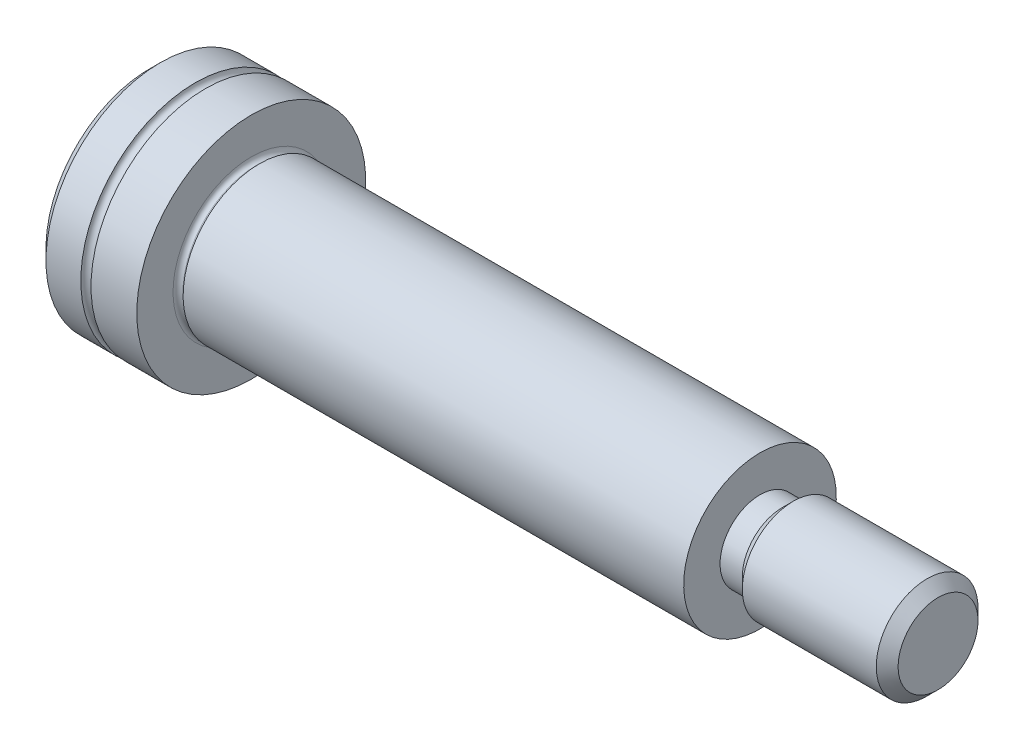
ISO-10303-21;
HEADER;
FILE_DESCRIPTION(('STEP AP214'),'2;1');
FILE_NAME('part.step','',(''),(''),'','','');
FILE_SCHEMA(('AUTOMOTIVE_DESIGN { 1 0 10303 214 1 1 1 1 }'));
ENDSEC;
DATA;
#1=APPLICATION_CONTEXT('core data for automotive mechanical design processes');
#2=APPLICATION_PROTOCOL_DEFINITION('international standard','automotive_design',2000,#1);
#3=PRODUCT_CONTEXT('',#1,'mechanical');
#4=PRODUCT('Part','Part','',(#3));
#5=PRODUCT_RELATED_PRODUCT_CATEGORY('part','',(#4));
#6=PRODUCT_DEFINITION_FORMATION('','',#4);
#7=PRODUCT_DEFINITION_CONTEXT('part definition',#1,'design');
#8=PRODUCT_DEFINITION('design','',#6,#7);
#9=PRODUCT_DEFINITION_SHAPE('','',#8);
#10=(LENGTH_UNIT() NAMED_UNIT(*) SI_UNIT(.MILLI.,.METRE.));
#11=(NAMED_UNIT(*) PLANE_ANGLE_UNIT() SI_UNIT($,.RADIAN.));
#12=(NAMED_UNIT(*) SI_UNIT($,.STERADIAN.) SOLID_ANGLE_UNIT());
#13=UNCERTAINTY_MEASURE_WITH_UNIT(LENGTH_MEASURE(1.E-05),#10,'distance_accuracy_value','');
#14=(GEOMETRIC_REPRESENTATION_CONTEXT(3) GLOBAL_UNCERTAINTY_ASSIGNED_CONTEXT((#13)) GLOBAL_UNIT_ASSIGNED_CONTEXT((#10,
#11,#12)) REPRESENTATION_CONTEXT('',''));
#15=CARTESIAN_POINT('',(0.,0.,0.));
#16=DIRECTION('',(0.,0.,1.));
#17=DIRECTION('',(1.,0.,0.));
#18=AXIS2_PLACEMENT_3D('',#15,#16,#17);
#19=CARTESIAN_POINT('',(0.,0.,0.));
#20=DIRECTION('',(-1.,0.,0.));
#21=DIRECTION('',(0.,-1.,0.));
#22=AXIS2_PLACEMENT_3D('',#19,#20,#21);
#23=CYLINDRICAL_SURFACE('',#22,4.5);
#24=CARTESIAN_POINT('',(0.,0.,0.));
#25=DIRECTION('',(-1.,0.,0.));
#26=DIRECTION('',(0.,-1.,0.));
#27=AXIS2_PLACEMENT_3D('',#24,#25,#26);
#28=CIRCLE('',#27,4.5);
#29=CARTESIAN_POINT('',(0.,-4.5,0.));
#30=VERTEX_POINT('',#29);
#31=EDGE_CURVE('E161',#30,#30,#28,.T.);
#32=ORIENTED_EDGE('',*,*,#31,.T.);
#33=EDGE_LOOP('',(#32));
#34=FACE_BOUND('',#33,.T.);
#35=CARTESIAN_POINT('',(-1.8,0.,0.));
#36=DIRECTION('',(-1.,0.,0.));
#37=DIRECTION('',(0.,-1.,0.));
#38=AXIS2_PLACEMENT_3D('',#35,#36,#37);
#39=CIRCLE('',#38,4.5);
#40=CARTESIAN_POINT('',(-1.8,-4.5,0.));
#41=VERTEX_POINT('',#40);
#42=EDGE_CURVE('E167',#41,#41,#39,.T.);
#43=ORIENTED_EDGE('',*,*,#42,.F.);
#44=EDGE_LOOP('',(#43));
#45=FACE_BOUND('',#44,.T.);
#46=ADVANCED_FACE('F33',(#34,#45),#23,.T.);
#47=CARTESIAN_POINT('',(-2.,0.,0.));
#48=DIRECTION('',(-1.,0.,0.));
#49=DIRECTION('',(0.,-1.,0.));
#50=AXIS2_PLACEMENT_3D('',#47,#48,#49);
#51=TOROIDAL_SURFACE('',#50,4.5,0.200000000000001);
#52=ORIENTED_EDGE('',*,*,#42,.T.);
#53=EDGE_LOOP('',(#52));
#54=FACE_BOUND('',#53,.T.);
#55=CARTESIAN_POINT('',(-2.2,0.,0.));
#56=DIRECTION('',(-1.,0.,0.));
#57=DIRECTION('',(0.,-1.,0.));
#58=AXIS2_PLACEMENT_3D('',#55,#56,#57);
#59=CIRCLE('',#58,4.5);
#60=CARTESIAN_POINT('',(-2.2,-4.5,0.));
#61=VERTEX_POINT('',#60);
#62=EDGE_CURVE('E164',#61,#61,#59,.T.);
#63=ORIENTED_EDGE('',*,*,#62,.F.);
#64=EDGE_LOOP('',(#63));
#65=FACE_BOUND('',#64,.T.);
#66=ADVANCED_FACE('F197',(#54,#65),#51,.F.);
#67=CARTESIAN_POINT('',(0.,0.,0.));
#68=DIRECTION('',(-1.,0.,0.));
#69=DIRECTION('',(0.,-1.,0.));
#70=AXIS2_PLACEMENT_3D('',#67,#68,#69);
#71=CYLINDRICAL_SURFACE('',#70,4.5);
#72=CARTESIAN_POINT('',(-3.57049999998492,0.,0.));
#73=DIRECTION('',(-1.,0.,0.));
#74=DIRECTION('',(0.,-1.,0.));
#75=AXIS2_PLACEMENT_3D('',#72,#73,#74);
#76=CIRCLE('',#75,4.5);
#77=CARTESIAN_POINT('',(-3.57049999998492,-4.5,0.));
#78=VERTEX_POINT('',#77);
#79=EDGE_CURVE('E173',#78,#78,#76,.F.);
#80=ORIENTED_EDGE('',*,*,#79,.T.);
#81=EDGE_LOOP('',(#80));
#82=FACE_BOUND('',#81,.T.);
#83=ORIENTED_EDGE('',*,*,#62,.T.);
#84=EDGE_LOOP('',(#83));
#85=FACE_BOUND('',#84,.T.);
#86=ADVANCED_FACE('F203',(#82,#85),#71,.T.);
#87=CARTESIAN_POINT('',(-4.,0.,0.));
#88=DIRECTION('',(-1.,0.,0.));
#89=DIRECTION('',(0.,-1.,0.));
#90=AXIS2_PLACEMENT_3D('',#87,#88,#89);
#91=PLANE('',#90);
#92=CARTESIAN_POINT('',(-4.,0.,0.));
#93=DIRECTION('',(-1.,0.,0.));
#94=DIRECTION('',(0.,-1.,0.));
#95=AXIS2_PLACEMENT_3D('',#92,#93,#94);
#96=CIRCLE('',#95,4.07050000004176);
#97=CARTESIAN_POINT('',(-4.,-4.07050000004176,0.));
#98=VERTEX_POINT('',#97);
#99=EDGE_CURVE('E170',#98,#98,#96,.T.);
#100=ORIENTED_EDGE('',*,*,#99,.T.);
#101=EDGE_LOOP('',(#100));
#102=FACE_BOUND('',#101,.T.);
#103=DIRECTION('',(0.,0.500000000000001,0.866025403784438));
#104=VECTOR('',#103,1.);
#105=CARTESIAN_POINT('',(-4.,-1.73205080756888,0.));
#106=LINE('',#105,#104);
#107=CARTESIAN_POINT('',(-4.,-1.73205080756888,0.));
#108=VERTEX_POINT('',#107);
#109=CARTESIAN_POINT('',(-4.,-0.866025403784439,1.5));
#110=VERTEX_POINT('',#109);
#111=EDGE_CURVE('E48',#108,#110,#106,.T.);
#112=ORIENTED_EDGE('',*,*,#111,.F.);
#113=DIRECTION('',(0.,-0.500000000000001,0.866025403784438));
#114=VECTOR('',#113,1.);
#115=CARTESIAN_POINT('',(-4.,-0.86602540378444,-1.5));
#116=LINE('',#115,#114);
#117=CARTESIAN_POINT('',(-4.,-0.86602540378444,-1.5));
#118=VERTEX_POINT('',#117);
#119=EDGE_CURVE('E134',#118,#108,#116,.T.);
#120=ORIENTED_EDGE('',*,*,#119,.F.);
#121=DIRECTION('',(0.,-1.,0.));
#122=VECTOR('',#121,1.);
#123=CARTESIAN_POINT('',(-4.,0.866025403784438,-1.5));
#124=LINE('',#123,#122);
#125=CARTESIAN_POINT('',(-4.,0.866025403784438,-1.5));
#126=VERTEX_POINT('',#125);
#127=EDGE_CURVE('E132',#126,#118,#124,.T.);
#128=ORIENTED_EDGE('',*,*,#127,.F.);
#129=DIRECTION('',(0.,-0.500000000000001,-0.866025403784438));
#130=VECTOR('',#129,1.);
#131=CARTESIAN_POINT('',(-4.,1.73205080756888,0.));
#132=LINE('',#131,#130);
#133=CARTESIAN_POINT('',(-4.,1.73205080756888,0.));
#134=VERTEX_POINT('',#133);
#135=EDGE_CURVE('E98',#134,#126,#132,.T.);
#136=ORIENTED_EDGE('',*,*,#135,.F.);
#137=DIRECTION('',(0.,0.5,-0.866025403784438));
#138=VECTOR('',#137,1.);
#139=CARTESIAN_POINT('',(-4.,0.86602540378444,1.5));
#140=LINE('',#139,#138);
#141=CARTESIAN_POINT('',(-4.,0.86602540378444,1.5));
#142=VERTEX_POINT('',#141);
#143=EDGE_CURVE('E128',#142,#134,#140,.T.);
#144=ORIENTED_EDGE('',*,*,#143,.F.);
#145=DIRECTION('',(0.,1.,0.));
#146=VECTOR('',#145,1.);
#147=CARTESIAN_POINT('',(-4.,-0.866025403784439,1.5));
#148=LINE('',#147,#146);
#149=EDGE_CURVE('E124',#110,#142,#148,.T.);
#150=ORIENTED_EDGE('',*,*,#149,.F.);
#151=EDGE_LOOP('',(#112,#120,#128,#136,#144,#150));
#152=FACE_BOUND('',#151,.T.);
#153=ADVANCED_FACE('F221',(#102,#152),#91,.T.);
#154=CARTESIAN_POINT('',(0.,4.5,0.));
#155=DIRECTION('',(1.,0.,0.));
#156=DIRECTION('',(0.,1.,0.));
#157=AXIS2_PLACEMENT_3D('',#154,#155,#156);
#158=PLANE('',#157);
#159=CARTESIAN_POINT('',(0.,0.,0.));
#160=DIRECTION('',(1.,0.,0.));
#161=DIRECTION('',(0.,1.,0.));
#162=AXIS2_PLACEMENT_3D('',#159,#160,#161);
#163=CIRCLE('',#162,3.075);
#164=CARTESIAN_POINT('',(0.,3.075,0.));
#165=VERTEX_POINT('',#164);
#166=EDGE_CURVE('E11',#165,#165,#163,.F.);
#167=ORIENTED_EDGE('',*,*,#166,.T.);
#168=EDGE_LOOP('',(#167));
#169=FACE_BOUND('',#168,.T.);
#170=ORIENTED_EDGE('',*,*,#31,.F.);
#171=EDGE_LOOP('',(#170));
#172=FACE_BOUND('',#171,.T.);
#173=ADVANCED_FACE('F224',(#169,#172),#158,.T.);
#174=CARTESIAN_POINT('',(0.250717967674063,0.,0.));
#175=DIRECTION('',(-1.,0.,0.));
#176=DIRECTION('',(0.,-1.,0.));
#177=AXIS2_PLACEMENT_3D('',#174,#175,#176);
#178=CYLINDRICAL_SURFACE('',#177,2.88);
#179=CARTESIAN_POINT('',(0.195,0.,0.));
#180=DIRECTION('',(1.,0.,0.));
#181=DIRECTION('',(0.,1.,0.));
#182=AXIS2_PLACEMENT_3D('',#179,#180,#181);
#183=CIRCLE('',#182,2.88);
#184=CARTESIAN_POINT('',(0.195,2.88,0.));
#185=VERTEX_POINT('',#184);
#186=EDGE_CURVE('E41',#185,#185,#183,.T.);
#187=ORIENTED_EDGE('',*,*,#186,.T.);
#188=EDGE_LOOP('',(#187));
#189=FACE_BOUND('',#188,.T.);
#190=CARTESIAN_POINT('',(0.250717967674063,0.,0.));
#191=DIRECTION('',(1.,0.,0.));
#192=DIRECTION('',(0.,1.,0.));
#193=AXIS2_PLACEMENT_3D('',#190,#191,#192);
#194=CIRCLE('',#193,2.88);
#195=CARTESIAN_POINT('',(0.250717967674063,2.88,0.));
#196=VERTEX_POINT('',#195);
#197=EDGE_CURVE('E158',#196,#196,#194,.T.);
#198=ORIENTED_EDGE('',*,*,#197,.F.);
#199=EDGE_LOOP('',(#198));
#200=FACE_BOUND('',#199,.T.);
#201=ADVANCED_FACE('F184',(#189,#200),#178,.T.);
#202=CARTESIAN_POINT('',(0.250717967674063,0.,0.));
#203=DIRECTION('',(1.,0.,0.));
#204=DIRECTION('',(0.,1.,0.));
#205=AXIS2_PLACEMENT_3D('',#202,#203,#204);
#206=CONICAL_SURFACE('',#205,2.87999999996304,1.04719755126488);
#207=CARTESIAN_POINT('',(0.320000000000001,0.,0.));
#208=DIRECTION('',(1.,0.,0.));
#209=DIRECTION('',(0.,1.,0.));
#210=AXIS2_PLACEMENT_3D('',#207,#208,#209);
#211=CIRCLE('',#210,3.00000000002212);
#212=CARTESIAN_POINT('',(0.320000000000001,3.00000000002212,0.));
#213=VERTEX_POINT('',#212);
#214=EDGE_CURVE('E155',#213,#213,#211,.T.);
#215=ORIENTED_EDGE('',*,*,#214,.F.);
#216=EDGE_LOOP('',(#215));
#217=FACE_BOUND('',#216,.T.);
#218=ORIENTED_EDGE('',*,*,#197,.T.);
#219=EDGE_LOOP('',(#218));
#220=FACE_BOUND('',#219,.T.);
#221=ADVANCED_FACE('F282',(#217,#220),#206,.T.);
#222=CARTESIAN_POINT('',(20.,0.,0.));
#223=DIRECTION('',(-1.,0.,0.));
#224=DIRECTION('',(0.,-1.,0.));
#225=AXIS2_PLACEMENT_3D('',#222,#223,#224);
#226=CYLINDRICAL_SURFACE('',#225,3.);
#227=CARTESIAN_POINT('',(20.,0.,0.));
#228=DIRECTION('',(1.,0.,0.));
#229=DIRECTION('',(0.,1.,0.));
#230=AXIS2_PLACEMENT_3D('',#227,#228,#229);
#231=CIRCLE('',#230,3.);
#232=CARTESIAN_POINT('',(20.,3.,0.));
#233=VERTEX_POINT('',#232);
#234=EDGE_CURVE('E150',#233,#233,#231,.T.);
#235=ORIENTED_EDGE('',*,*,#234,.F.);
#236=EDGE_LOOP('',(#235));
#237=FACE_BOUND('',#236,.T.);
#238=ORIENTED_EDGE('',*,*,#214,.T.);
#239=EDGE_LOOP('',(#238));
#240=FACE_BOUND('',#239,.T.);
#241=ADVANCED_FACE('F278',(#237,#240),#226,.T.);
#242=CARTESIAN_POINT('',(20.,0.,0.));
#243=DIRECTION('',(1.,0.,0.));
#244=DIRECTION('',(0.,1.,0.));
#245=AXIS2_PLACEMENT_3D('',#242,#243,#244);
#246=PLANE('',#245);
#247=CARTESIAN_POINT('',(20.,0.,0.));
#248=DIRECTION('',(1.,0.,0.));
#249=DIRECTION('',(0.,1.,0.));
#250=AXIS2_PLACEMENT_3D('',#247,#248,#249);
#251=CIRCLE('',#250,1.5705);
#252=CARTESIAN_POINT('',(20.,1.5705,0.));
#253=VERTEX_POINT('',#252);
#254=EDGE_CURVE('E146',#253,#253,#251,.T.);
#255=ORIENTED_EDGE('',*,*,#254,.F.);
#256=EDGE_LOOP('',(#255));
#257=FACE_BOUND('',#256,.T.);
#258=ORIENTED_EDGE('',*,*,#234,.T.);
#259=EDGE_LOOP('',(#258));
#260=FACE_BOUND('',#259,.T.);
#261=ADVANCED_FACE('F274',(#257,#260),#246,.T.);
#262=CARTESIAN_POINT('',(20.875,0.,0.));
#263=DIRECTION('',(-1.,0.,0.));
#264=DIRECTION('',(0.,-1.,0.));
#265=AXIS2_PLACEMENT_3D('',#262,#263,#264);
#266=CYLINDRICAL_SURFACE('',#265,1.5705);
#267=CARTESIAN_POINT('',(20.875,0.,0.));
#268=DIRECTION('',(1.,0.,0.));
#269=DIRECTION('',(0.,1.,0.));
#270=AXIS2_PLACEMENT_3D('',#267,#268,#269);
#271=CIRCLE('',#270,1.5705);
#272=CARTESIAN_POINT('',(20.875,1.5705,0.));
#273=VERTEX_POINT('',#272);
#274=EDGE_CURVE('E147',#273,#273,#271,.T.);
#275=ORIENTED_EDGE('',*,*,#274,.F.);
#276=EDGE_LOOP('',(#275));
#277=FACE_BOUND('',#276,.T.);
#278=ORIENTED_EDGE('',*,*,#254,.T.);
#279=EDGE_LOOP('',(#278));
#280=FACE_BOUND('',#279,.T.);
#281=ADVANCED_FACE('F270',(#277,#280),#266,.T.);
#282=CARTESIAN_POINT('',(20.875,0.,0.));
#283=DIRECTION('',(1.,0.,0.));
#284=DIRECTION('',(0.,1.,0.));
#285=AXIS2_PLACEMENT_3D('',#282,#283,#284);
#286=CONICAL_SURFACE('',#285,1.57049999996752,0.785398163397452);
#287=CARTESIAN_POINT('',(21.3044999999852,0.,0.));
#288=DIRECTION('',(1.,0.,0.));
#289=DIRECTION('',(0.,1.,0.));
#290=AXIS2_PLACEMENT_3D('',#287,#288,#289);
#291=CIRCLE('',#290,1.99999999995271);
#292=CARTESIAN_POINT('',(21.3044999999852,1.99999999995271,0.));
#293=VERTEX_POINT('',#292);
#294=EDGE_CURVE('E138',#293,#293,#291,.T.);
#295=ORIENTED_EDGE('',*,*,#294,.F.);
#296=EDGE_LOOP('',(#295));
#297=FACE_BOUND('',#296,.T.);
#298=ORIENTED_EDGE('',*,*,#274,.T.);
#299=EDGE_LOOP('',(#298));
#300=FACE_BOUND('',#299,.T.);
#301=ADVANCED_FACE('F266',(#297,#300),#286,.T.);
#302=CARTESIAN_POINT('',(27.,0.,0.));
#303=DIRECTION('',(-1.,0.,0.));
#304=DIRECTION('',(0.,-1.,0.));
#305=AXIS2_PLACEMENT_3D('',#302,#303,#304);
#306=CYLINDRICAL_SURFACE('',#305,2.);
#307=CARTESIAN_POINT('',(26.5704999999849,0.,0.));
#308=DIRECTION('',(1.,0.,0.));
#309=DIRECTION('',(0.,1.,0.));
#310=AXIS2_PLACEMENT_3D('',#307,#308,#309);
#311=CIRCLE('',#310,2.);
#312=CARTESIAN_POINT('',(26.5704999999849,2.,0.));
#313=VERTEX_POINT('',#312);
#314=EDGE_CURVE('E179',#313,#313,#311,.F.);
#315=ORIENTED_EDGE('',*,*,#314,.T.);
#316=EDGE_LOOP('',(#315));
#317=FACE_BOUND('',#316,.T.);
#318=ORIENTED_EDGE('',*,*,#294,.T.);
#319=EDGE_LOOP('',(#318));
#320=FACE_BOUND('',#319,.T.);
#321=ADVANCED_FACE('F262',(#317,#320),#306,.T.);
#322=CARTESIAN_POINT('',(27.,0.,0.));
#323=DIRECTION('',(1.,0.,0.));
#324=DIRECTION('',(0.,1.,0.));
#325=AXIS2_PLACEMENT_3D('',#322,#323,#324);
#326=PLANE('',#325);
#327=CARTESIAN_POINT('',(27.,0.,0.));
#328=DIRECTION('',(1.,0.,0.));
#329=DIRECTION('',(0.,1.,0.));
#330=AXIS2_PLACEMENT_3D('',#327,#328,#329);
#331=CIRCLE('',#330,1.57050000004177);
#332=CARTESIAN_POINT('',(27.,1.57050000004177,0.));
#333=VERTEX_POINT('',#332);
#334=EDGE_CURVE('E176',#333,#333,#331,.T.);
#335=ORIENTED_EDGE('',*,*,#334,.T.);
#336=EDGE_LOOP('',(#335));
#337=FACE_BOUND('',#336,.T.);
#338=ADVANCED_FACE('F259',(#337),#326,.T.);
#339=CARTESIAN_POINT('',(-2.,-1.73205080756888,0.));
#340=DIRECTION('',(0.,-0.866025403784438,0.500000000000001));
#341=DIRECTION('',(0.,-0.500000000000001,-0.866025403784438));
#342=AXIS2_PLACEMENT_3D('',#339,#340,#341);
#343=PLANE('',#342);
#344=ORIENTED_EDGE('',*,*,#111,.T.);
#345=DIRECTION('',(-1.,0.,0.));
#346=VECTOR('',#345,1.);
#347=CARTESIAN_POINT('',(-2.,-0.866025403784439,1.5));
#348=LINE('',#347,#346);
#349=CARTESIAN_POINT('',(-2.,-0.866025403784439,1.5));
#350=VERTEX_POINT('',#349);
#351=EDGE_CURVE('E79',#350,#110,#348,.T.);
#352=ORIENTED_EDGE('',*,*,#351,.F.);
#353=DIRECTION('',(0.,0.500000000000001,0.866025403784438));
#354=VECTOR('',#353,1.);
#355=CARTESIAN_POINT('',(-2.,-1.73205080756888,0.));
#356=LINE('',#355,#354);
#357=CARTESIAN_POINT('',(-2.,-1.73205080756888,0.));
#358=VERTEX_POINT('',#357);
#359=EDGE_CURVE('E136',#358,#350,#356,.T.);
#360=ORIENTED_EDGE('',*,*,#359,.F.);
#361=DIRECTION('',(-1.,0.,0.));
#362=VECTOR('',#361,1.);
#363=CARTESIAN_POINT('',(-2.,-1.73205080756888,0.));
#364=LINE('',#363,#362);
#365=EDGE_CURVE('E56',#358,#108,#364,.T.);
#366=ORIENTED_EDGE('',*,*,#365,.T.);
#367=EDGE_LOOP('',(#344,#352,#360,#366));
#368=FACE_BOUND('',#367,.T.);
#369=ADVANCED_FACE('F249',(#368),#343,.F.);
#370=CARTESIAN_POINT('',(-2.,-0.86602540378444,-1.5));
#371=DIRECTION('',(0.,-0.866025403784438,-0.500000000000001));
#372=DIRECTION('',(0.,0.500000000000001,-0.866025403784438));
#373=AXIS2_PLACEMENT_3D('',#370,#371,#372);
#374=PLANE('',#373);
#375=ORIENTED_EDGE('',*,*,#119,.T.);
#376=ORIENTED_EDGE('',*,*,#365,.F.);
#377=DIRECTION('',(0.,-0.500000000000001,0.866025403784438));
#378=VECTOR('',#377,1.);
#379=CARTESIAN_POINT('',(-2.,-0.86602540378444,-1.5));
#380=LINE('',#379,#378);
#381=CARTESIAN_POINT('',(-2.,-0.86602540378444,-1.5));
#382=VERTEX_POINT('',#381);
#383=EDGE_CURVE('E110',#382,#358,#380,.T.);
#384=ORIENTED_EDGE('',*,*,#383,.F.);
#385=DIRECTION('',(-1.,0.,0.));
#386=VECTOR('',#385,1.);
#387=CARTESIAN_POINT('',(-2.,-0.86602540378444,-1.5));
#388=LINE('',#387,#386);
#389=EDGE_CURVE('E102',#382,#118,#388,.T.);
#390=ORIENTED_EDGE('',*,*,#389,.T.);
#391=EDGE_LOOP('',(#375,#376,#384,#390));
#392=FACE_BOUND('',#391,.T.);
#393=ADVANCED_FACE('F246',(#392),#374,.F.);
#394=CARTESIAN_POINT('',(-2.,0.866025403784438,-1.5));
#395=DIRECTION('',(0.,0.,-1.));
#396=DIRECTION('',(0.,1.,0.));
#397=AXIS2_PLACEMENT_3D('',#394,#395,#396);
#398=PLANE('',#397);
#399=ORIENTED_EDGE('',*,*,#127,.T.);
#400=ORIENTED_EDGE('',*,*,#389,.F.);
#401=DIRECTION('',(0.,-1.,0.));
#402=VECTOR('',#401,1.);
#403=CARTESIAN_POINT('',(-2.,0.866025403784438,-1.5));
#404=LINE('',#403,#402);
#405=CARTESIAN_POINT('',(-2.,0.866025403784438,-1.5));
#406=VERTEX_POINT('',#405);
#407=EDGE_CURVE('E106',#406,#382,#404,.T.);
#408=ORIENTED_EDGE('',*,*,#407,.F.);
#409=DIRECTION('',(-1.,0.,0.));
#410=VECTOR('',#409,1.);
#411=CARTESIAN_POINT('',(-2.,0.866025403784438,-1.5));
#412=LINE('',#411,#410);
#413=EDGE_CURVE('E91',#406,#126,#412,.T.);
#414=ORIENTED_EDGE('',*,*,#413,.T.);
#415=EDGE_LOOP('',(#399,#400,#408,#414));
#416=FACE_BOUND('',#415,.T.);
#417=ADVANCED_FACE('F107',(#416),#398,.F.);
#418=CARTESIAN_POINT('',(-2.,1.73205080756888,0.));
#419=DIRECTION('',(0.,0.866025403784438,-0.500000000000001));
#420=DIRECTION('',(0.,0.500000000000001,0.866025403784438));
#421=AXIS2_PLACEMENT_3D('',#418,#419,#420);
#422=PLANE('',#421);
#423=ORIENTED_EDGE('',*,*,#135,.T.);
#424=ORIENTED_EDGE('',*,*,#413,.F.);
#425=DIRECTION('',(0.,-0.500000000000001,-0.866025403784438));
#426=VECTOR('',#425,1.);
#427=CARTESIAN_POINT('',(-2.,1.73205080756888,0.));
#428=LINE('',#427,#426);
#429=CARTESIAN_POINT('',(-2.,1.73205080756888,0.));
#430=VERTEX_POINT('',#429);
#431=EDGE_CURVE('E95',#430,#406,#428,.T.);
#432=ORIENTED_EDGE('',*,*,#431,.F.);
#433=DIRECTION('',(-1.,0.,0.));
#434=VECTOR('',#433,1.);
#435=CARTESIAN_POINT('',(-2.,1.73205080756888,0.));
#436=LINE('',#435,#434);
#437=EDGE_CURVE('E103',#430,#134,#436,.T.);
#438=ORIENTED_EDGE('',*,*,#437,.T.);
#439=EDGE_LOOP('',(#423,#424,#432,#438));
#440=FACE_BOUND('',#439,.T.);
#441=ADVANCED_FACE('F93',(#440),#422,.F.);
#442=CARTESIAN_POINT('',(-2.,0.86602540378444,1.5));
#443=DIRECTION('',(0.,0.866025403784438,0.5));
#444=DIRECTION('',(0.,-0.5,0.866025403784439));
#445=AXIS2_PLACEMENT_3D('',#442,#443,#444);
#446=PLANE('',#445);
#447=ORIENTED_EDGE('',*,*,#143,.T.);
#448=ORIENTED_EDGE('',*,*,#437,.F.);
#449=DIRECTION('',(0.,0.5,-0.866025403784438));
#450=VECTOR('',#449,1.);
#451=CARTESIAN_POINT('',(-2.,0.86602540378444,1.5));
#452=LINE('',#451,#450);
#453=CARTESIAN_POINT('',(-2.,0.86602540378444,1.5));
#454=VERTEX_POINT('',#453);
#455=EDGE_CURVE('E116',#454,#430,#452,.T.);
#456=ORIENTED_EDGE('',*,*,#455,.F.);
#457=DIRECTION('',(-1.,0.,0.));
#458=VECTOR('',#457,1.);
#459=CARTESIAN_POINT('',(-2.,0.86602540378444,1.5));
#460=LINE('',#459,#458);
#461=EDGE_CURVE('E141',#454,#142,#460,.T.);
#462=ORIENTED_EDGE('',*,*,#461,.T.);
#463=EDGE_LOOP('',(#447,#448,#456,#462));
#464=FACE_BOUND('',#463,.T.);
#465=ADVANCED_FACE('F243',(#464),#446,.F.);
#466=CARTESIAN_POINT('',(-2.,-0.866025403784439,1.5));
#467=DIRECTION('',(0.,0.,1.));
#468=DIRECTION('',(0.,-1.,0.));
#469=AXIS2_PLACEMENT_3D('',#466,#467,#468);
#470=PLANE('',#469);
#471=ORIENTED_EDGE('',*,*,#149,.T.);
#472=ORIENTED_EDGE('',*,*,#461,.F.);
#473=DIRECTION('',(0.,1.,0.));
#474=VECTOR('',#473,1.);
#475=CARTESIAN_POINT('',(-2.,-0.866025403784439,1.5));
#476=LINE('',#475,#474);
#477=EDGE_CURVE('E118',#350,#454,#476,.T.);
#478=ORIENTED_EDGE('',*,*,#477,.F.);
#479=ORIENTED_EDGE('',*,*,#351,.T.);
#480=EDGE_LOOP('',(#471,#472,#478,#479));
#481=FACE_BOUND('',#480,.T.);
#482=ADVANCED_FACE('F230',(#481),#470,.F.);
#483=CARTESIAN_POINT('',(-2.,0.,0.));
#484=DIRECTION('',(-1.,0.,0.));
#485=DIRECTION('',(0.,0.,1.));
#486=AXIS2_PLACEMENT_3D('',#483,#484,#485);
#487=PLANE('',#486);
#488=CARTESIAN_POINT('',(-2.00000000000108,0.,0.));
#489=DIRECTION('',(1.,0.,0.));
#490=DIRECTION('',(0.,0.,-1.));
#491=AXIS2_PLACEMENT_3D('',#488,#489,#490);
#492=CIRCLE('',#491,1.43999999999921);
#493=CARTESIAN_POINT('',(-2.00000000000108,0.,-1.43999999999921));
#494=VERTEX_POINT('',#493);
#495=EDGE_CURVE('E125',#494,#494,#492,.T.);
#496=ORIENTED_EDGE('',*,*,#495,.T.);
#497=EDGE_LOOP('',(#496));
#498=FACE_BOUND('',#497,.T.);
#499=ORIENTED_EDGE('',*,*,#359,.T.);
#500=ORIENTED_EDGE('',*,*,#477,.T.);
#501=ORIENTED_EDGE('',*,*,#455,.T.);
#502=ORIENTED_EDGE('',*,*,#431,.T.);
#503=ORIENTED_EDGE('',*,*,#407,.T.);
#504=ORIENTED_EDGE('',*,*,#383,.T.);
#505=EDGE_LOOP('',(#499,#500,#501,#502,#503,#504));
#506=FACE_BOUND('',#505,.T.);
#507=ADVANCED_FACE('F113',(#498,#506),#487,.T.);
#508=CARTESIAN_POINT('',(-1.16861561236847,0.,0.));
#509=DIRECTION('',(-1.,0.,0.));
#510=DIRECTION('',(0.,0.,1.));
#511=AXIS2_PLACEMENT_3D('',#508,#509,#510);
#512=CONICAL_SURFACE('',#511,0.,1.0471975511966);
#513=ORIENTED_EDGE('',*,*,#495,.F.);
#514=EDGE_LOOP('',(#513));
#515=FACE_BOUND('',#514,.T.);
#516=CARTESIAN_POINT('',(-1.16861561236847,0.,0.));
#517=VERTEX_POINT('',#516);
#518=VERTEX_LOOP('',#517);
#519=FACE_BOUND('',#518,.T.);
#520=ADVANCED_FACE('F210',(#515,#519),#512,.F.);
#521=CARTESIAN_POINT('',(-4.,0.,0.));
#522=DIRECTION('',(1.,0.,0.));
#523=DIRECTION('',(0.,1.,0.));
#524=AXIS2_PLACEMENT_3D('',#521,#522,#523);
#525=CONICAL_SURFACE('',#524,4.07050000004176,0.785398163331275);
#526=ORIENTED_EDGE('',*,*,#79,.F.);
#527=EDGE_LOOP('',(#526));
#528=FACE_BOUND('',#527,.T.);
#529=ORIENTED_EDGE('',*,*,#99,.F.);
#530=EDGE_LOOP('',(#529));
#531=FACE_BOUND('',#530,.T.);
#532=ADVANCED_FACE('F193',(#528,#531),#525,.T.);
#533=CARTESIAN_POINT('',(27.,0.,0.));
#534=DIRECTION('',(-1.,0.,0.));
#535=DIRECTION('',(0.,-1.,0.));
#536=AXIS2_PLACEMENT_3D('',#533,#534,#535);
#537=CONICAL_SURFACE('',#536,1.57050000004177,0.785398163331272);
#538=ORIENTED_EDGE('',*,*,#314,.F.);
#539=EDGE_LOOP('',(#538));
#540=FACE_BOUND('',#539,.T.);
#541=ORIENTED_EDGE('',*,*,#334,.F.);
#542=EDGE_LOOP('',(#541));
#543=FACE_BOUND('',#542,.T.);
#544=ADVANCED_FACE('F188',(#540,#543),#537,.T.);
#545=CARTESIAN_POINT('',(0.195,0.,0.));
#546=DIRECTION('',(1.,0.,0.));
#547=DIRECTION('',(0.,1.,0.));
#548=AXIS2_PLACEMENT_3D('',#545,#546,#547);
#549=TOROIDAL_SURFACE('',#548,3.075,0.195);
#550=ORIENTED_EDGE('',*,*,#166,.F.);
#551=EDGE_LOOP('',(#550));
#552=FACE_BOUND('',#551,.T.);
#553=ORIENTED_EDGE('',*,*,#186,.F.);
#554=EDGE_LOOP('',(#553));
#555=FACE_BOUND('',#554,.T.);
#556=ADVANCED_FACE('F35',(#552,#555),#549,.F.);
#557=CLOSED_SHELL('',(#46,#66,#86,#153,#173,#201,#221,#241,#261,#281,#301,#321,#338,#369,#393,
#417,#441,#465,#482,#507,#520,#532,#544,#556));
#558=MANIFOLD_SOLID_BREP('B2',#557);
#559=ADVANCED_BREP_SHAPE_REPRESENTATION('',(#18,#558),#14);
#560=SHAPE_DEFINITION_REPRESENTATION(#9,#559);
ENDSEC;
END-ISO-10303-21;
